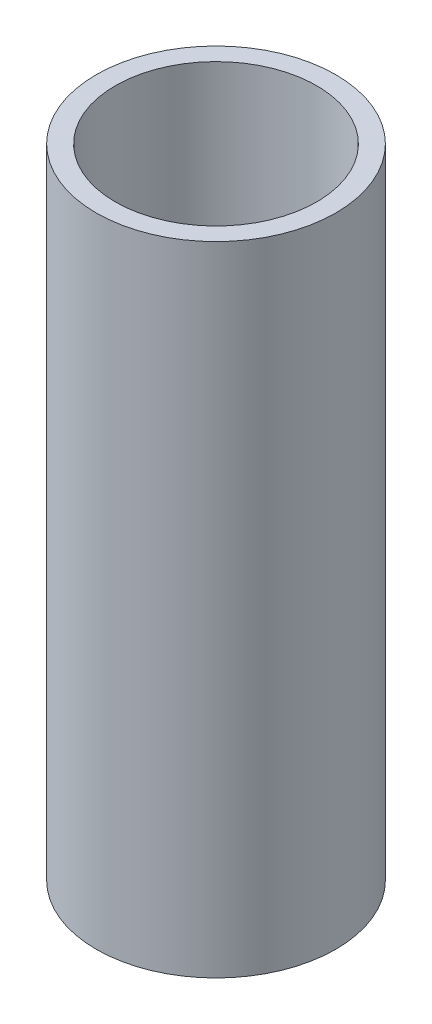
ISO-10303-21;
HEADER;
FILE_DESCRIPTION(('STEP AP214'),'2;1');
FILE_NAME('part.step','',(''),(''),'','','');
FILE_SCHEMA(('AUTOMOTIVE_DESIGN { 1 0 10303 214 1 1 1 1 }'));
ENDSEC;
DATA;
#1=APPLICATION_CONTEXT('core data for automotive mechanical design processes');
#2=APPLICATION_PROTOCOL_DEFINITION('international standard','automotive_design',2000,#1);
#3=PRODUCT_CONTEXT('',#1,'mechanical');
#4=PRODUCT('Part','Part','',(#3));
#5=PRODUCT_RELATED_PRODUCT_CATEGORY('part','',(#4));
#6=PRODUCT_DEFINITION_FORMATION('','',#4);
#7=PRODUCT_DEFINITION_CONTEXT('part definition',#1,'design');
#8=PRODUCT_DEFINITION('design','',#6,#7);
#9=PRODUCT_DEFINITION_SHAPE('','',#8);
#10=(LENGTH_UNIT() NAMED_UNIT(*) SI_UNIT(.MILLI.,.METRE.));
#11=(NAMED_UNIT(*) PLANE_ANGLE_UNIT() SI_UNIT($,.RADIAN.));
#12=(NAMED_UNIT(*) SI_UNIT($,.STERADIAN.) SOLID_ANGLE_UNIT());
#13=UNCERTAINTY_MEASURE_WITH_UNIT(LENGTH_MEASURE(1.E-05),#10,'distance_accuracy_value','');
#14=(GEOMETRIC_REPRESENTATION_CONTEXT(3) GLOBAL_UNCERTAINTY_ASSIGNED_CONTEXT((#13)) GLOBAL_UNIT_ASSIGNED_CONTEXT((#10,
#11,#12)) REPRESENTATION_CONTEXT('',''));
#15=CARTESIAN_POINT('',(0.,0.,0.));
#16=DIRECTION('',(0.,0.,1.));
#17=DIRECTION('',(1.,0.,0.));
#18=AXIS2_PLACEMENT_3D('',#15,#16,#17);
#19=CARTESIAN_POINT('',(0.,133.09145490831,0.));
#20=DIRECTION('',(0.,-1.,0.));
#21=DIRECTION('',(0.,0.,-1.));
#22=AXIS2_PLACEMENT_3D('',#19,#20,#21);
#23=CYLINDRICAL_SURFACE('',#22,25.);
#24=CARTESIAN_POINT('',(0.,133.09145490831,0.));
#25=DIRECTION('',(0.,1.,0.));
#26=DIRECTION('',(0.,0.,1.));
#27=AXIS2_PLACEMENT_3D('',#24,#25,#26);
#28=CIRCLE('',#27,25.);
#29=CARTESIAN_POINT('',(0.,133.09145490831,25.));
#30=VERTEX_POINT('',#29);
#31=EDGE_CURVE('E10',#30,#30,#28,.T.);
#32=ORIENTED_EDGE('',*,*,#31,.F.);
#33=EDGE_LOOP('',(#32));
#34=FACE_BOUND('',#33,.T.);
#35=CARTESIAN_POINT('',(0.,0.,0.));
#36=DIRECTION('',(0.,1.,0.));
#37=DIRECTION('',(0.,0.,1.));
#38=AXIS2_PLACEMENT_3D('',#35,#36,#37);
#39=CIRCLE('',#38,25.);
#40=CARTESIAN_POINT('',(0.,0.,25.));
#41=VERTEX_POINT('',#40);
#42=EDGE_CURVE('E37',#41,#41,#39,.T.);
#43=ORIENTED_EDGE('',*,*,#42,.T.);
#44=EDGE_LOOP('',(#43));
#45=FACE_BOUND('',#44,.T.);
#46=ADVANCED_FACE('F40',(#34,#45),#23,.T.);
#47=CARTESIAN_POINT('',(0.,133.09145490831,0.));
#48=DIRECTION('',(0.,1.,0.));
#49=DIRECTION('',(0.,0.,1.));
#50=AXIS2_PLACEMENT_3D('',#47,#48,#49);
#51=PLANE('',#50);
#52=CARTESIAN_POINT('',(0.,133.09145490831,0.));
#53=DIRECTION('',(0.,1.,0.));
#54=DIRECTION('',(0.,0.,1.));
#55=AXIS2_PLACEMENT_3D('',#52,#53,#54);
#56=CIRCLE('',#55,21.0171349784831);
#57=CARTESIAN_POINT('',(0.,133.09145490831,21.0171349784831));
#58=VERTEX_POINT('',#57);
#59=EDGE_CURVE('E50',#58,#58,#56,.T.);
#60=ORIENTED_EDGE('',*,*,#59,.F.);
#61=EDGE_LOOP('',(#60));
#62=FACE_BOUND('',#61,.T.);
#63=ORIENTED_EDGE('',*,*,#31,.T.);
#64=EDGE_LOOP('',(#63));
#65=FACE_BOUND('',#64,.T.);
#66=ADVANCED_FACE('F59',(#62,#65),#51,.T.);
#67=CARTESIAN_POINT('',(0.,0.,0.));
#68=DIRECTION('',(0.,1.,0.));
#69=DIRECTION('',(0.,0.,1.));
#70=AXIS2_PLACEMENT_3D('',#67,#68,#69);
#71=PLANE('',#70);
#72=CARTESIAN_POINT('',(0.,0.,0.));
#73=DIRECTION('',(0.,1.,0.));
#74=DIRECTION('',(0.,0.,1.));
#75=AXIS2_PLACEMENT_3D('',#72,#73,#74);
#76=CIRCLE('',#75,21.0171349784831);
#77=CARTESIAN_POINT('',(0.,0.,21.0171349784831));
#78=VERTEX_POINT('',#77);
#79=EDGE_CURVE('E47',#78,#78,#76,.T.);
#80=ORIENTED_EDGE('',*,*,#79,.T.);
#81=EDGE_LOOP('',(#80));
#82=FACE_BOUND('',#81,.T.);
#83=ORIENTED_EDGE('',*,*,#42,.F.);
#84=EDGE_LOOP('',(#83));
#85=FACE_BOUND('',#84,.T.);
#86=ADVANCED_FACE('F58',(#82,#85),#71,.F.);
#87=CARTESIAN_POINT('',(0.,133.09145490831,0.));
#88=DIRECTION('',(0.,-1.,0.));
#89=DIRECTION('',(0.,0.,-1.));
#90=AXIS2_PLACEMENT_3D('',#87,#88,#89);
#91=CYLINDRICAL_SURFACE('',#90,21.0171349784831);
#92=ORIENTED_EDGE('',*,*,#59,.T.);
#93=EDGE_LOOP('',(#92));
#94=FACE_BOUND('',#93,.T.);
#95=ORIENTED_EDGE('',*,*,#79,.F.);
#96=EDGE_LOOP('',(#95));
#97=FACE_BOUND('',#96,.T.);
#98=ADVANCED_FACE('F54',(#94,#97),#91,.F.);
#99=CLOSED_SHELL('',(#46,#66,#86,#98));
#100=MANIFOLD_SOLID_BREP('B2',#99);
#101=ADVANCED_BREP_SHAPE_REPRESENTATION('',(#18,#100),#14);
#102=SHAPE_DEFINITION_REPRESENTATION(#9,#101);
ENDSEC;
END-ISO-10303-21;
